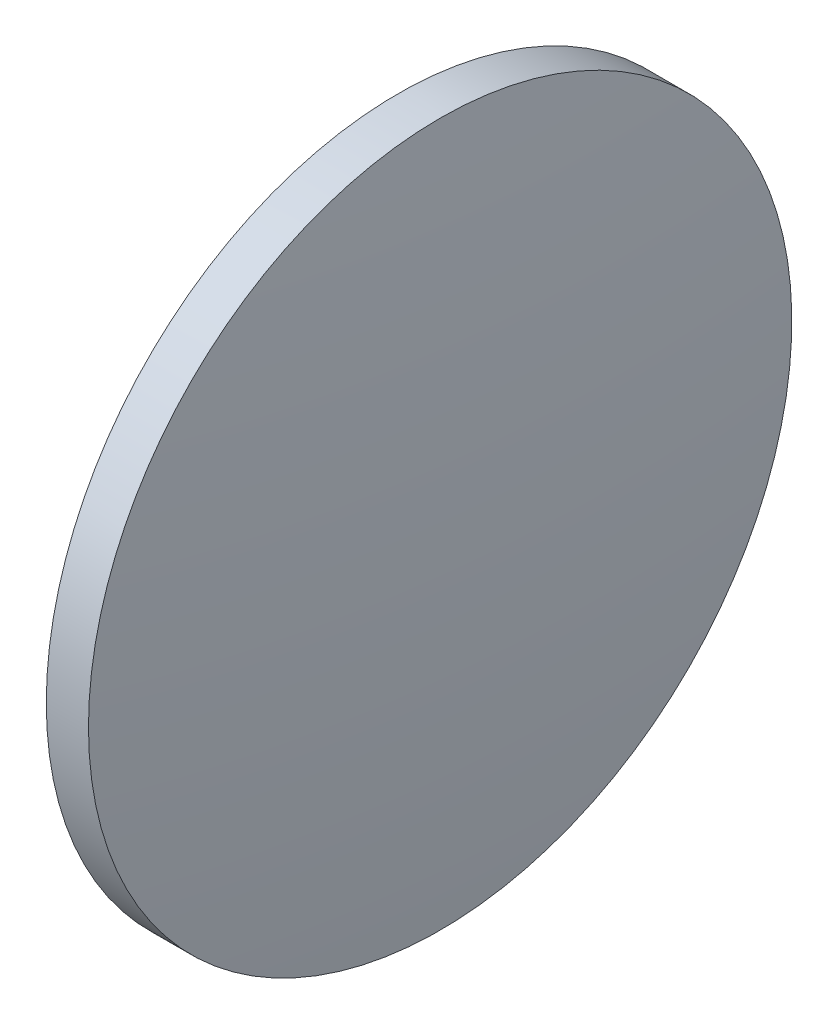
ISO-10303-21;
HEADER;
FILE_DESCRIPTION(('STEP AP214'),'2;1');
FILE_NAME('part.step','',(''),(''),'','','');
FILE_SCHEMA(('AUTOMOTIVE_DESIGN { 1 0 10303 214 1 1 1 1 }'));
ENDSEC;
DATA;
#1=APPLICATION_CONTEXT('core data for automotive mechanical design processes');
#2=APPLICATION_PROTOCOL_DEFINITION('international standard','automotive_design',2000,#1);
#3=PRODUCT_CONTEXT('',#1,'mechanical');
#4=PRODUCT('Part','Part','',(#3));
#5=PRODUCT_RELATED_PRODUCT_CATEGORY('part','',(#4));
#6=PRODUCT_DEFINITION_FORMATION('','',#4);
#7=PRODUCT_DEFINITION_CONTEXT('part definition',#1,'design');
#8=PRODUCT_DEFINITION('design','',#6,#7);
#9=PRODUCT_DEFINITION_SHAPE('','',#8);
#10=(LENGTH_UNIT() NAMED_UNIT(*) SI_UNIT(.MILLI.,.METRE.));
#11=(NAMED_UNIT(*) PLANE_ANGLE_UNIT() SI_UNIT($,.RADIAN.));
#12=(NAMED_UNIT(*) SI_UNIT($,.STERADIAN.) SOLID_ANGLE_UNIT());
#13=UNCERTAINTY_MEASURE_WITH_UNIT(LENGTH_MEASURE(1.E-05),#10,'distance_accuracy_value','');
#14=(GEOMETRIC_REPRESENTATION_CONTEXT(3) GLOBAL_UNCERTAINTY_ASSIGNED_CONTEXT((#13)) GLOBAL_UNIT_ASSIGNED_CONTEXT((#10,
#11,#12)) REPRESENTATION_CONTEXT('',''));
#15=CARTESIAN_POINT('',(0.,0.,0.));
#16=DIRECTION('',(0.,0.,1.));
#17=DIRECTION('',(1.,0.,0.));
#18=AXIS2_PLACEMENT_3D('',#15,#16,#17);
#19=CARTESIAN_POINT('',(207.345173472118,88.871318013225,0.));
#20=DIRECTION('',(-1.,0.,0.));
#21=DIRECTION('',(0.,1.,0.));
#22=AXIS2_PLACEMENT_3D('',#19,#20,#21);
#23=SPHERICAL_SURFACE('',#22,258.869462809919);
#24=CARTESIAN_POINT('',(465.004636282036,88.871318013225,0.));
#25=DIRECTION('',(-1.,0.,0.));
#26=DIRECTION('',(0.,0.,1.));
#27=AXIS2_PLACEMENT_3D('',#24,#25,#26);
#28=CIRCLE('',#27,25.);
#29=CARTESIAN_POINT('',(465.004636282036,88.871318013225,25.));
#30=VERTEX_POINT('',#29);
#31=EDGE_CURVE('E10',#30,#30,#28,.T.);
#32=ORIENTED_EDGE('',*,*,#31,.F.);
#33=EDGE_LOOP('',(#32));
#34=FACE_BOUND('',#33,.T.);
#35=ADVANCED_FACE('F35',(#34),#23,.T.);
#36=CARTESIAN_POINT('',(457.859624532796,88.871318013225,0.));
#37=DIRECTION('',(-1.,0.,0.));
#38=DIRECTION('',(0.,0.,1.));
#39=AXIS2_PLACEMENT_3D('',#36,#37,#38);
#40=CYLINDRICAL_SURFACE('',#39,25.);
#41=CARTESIAN_POINT('',(462.004636282036,88.871318013225,0.));
#42=DIRECTION('',(-1.,0.,0.));
#43=DIRECTION('',(0.,0.,1.));
#44=AXIS2_PLACEMENT_3D('',#41,#42,#43);
#45=CIRCLE('',#44,25.);
#46=CARTESIAN_POINT('',(462.004636282036,88.871318013225,25.));
#47=VERTEX_POINT('',#46);
#48=EDGE_CURVE('E41',#47,#47,#45,.T.);
#49=ORIENTED_EDGE('',*,*,#48,.F.);
#50=EDGE_LOOP('',(#49));
#51=FACE_BOUND('',#50,.T.);
#52=ORIENTED_EDGE('',*,*,#31,.T.);
#53=EDGE_LOOP('',(#52));
#54=FACE_BOUND('',#53,.T.);
#55=ADVANCED_FACE('F49',(#51,#54),#40,.T.);
#56=CARTESIAN_POINT('',(462.004636282036,88.871318013225,0.));
#57=DIRECTION('',(1.,0.,0.));
#58=DIRECTION('',(0.,0.,-1.));
#59=AXIS2_PLACEMENT_3D('',#56,#57,#58);
#60=PLANE('',#59);
#61=ORIENTED_EDGE('',*,*,#48,.T.);
#62=EDGE_LOOP('',(#61));
#63=FACE_BOUND('',#62,.T.);
#64=ADVANCED_FACE('F47',(#63),#60,.F.);
#65=CLOSED_SHELL('',(#35,#55,#64));
#66=MANIFOLD_SOLID_BREP('B2',#65);
#67=ADVANCED_BREP_SHAPE_REPRESENTATION('',(#18,#66),#14);
#68=SHAPE_DEFINITION_REPRESENTATION(#9,#67);
ENDSEC;
END-ISO-10303-21;
